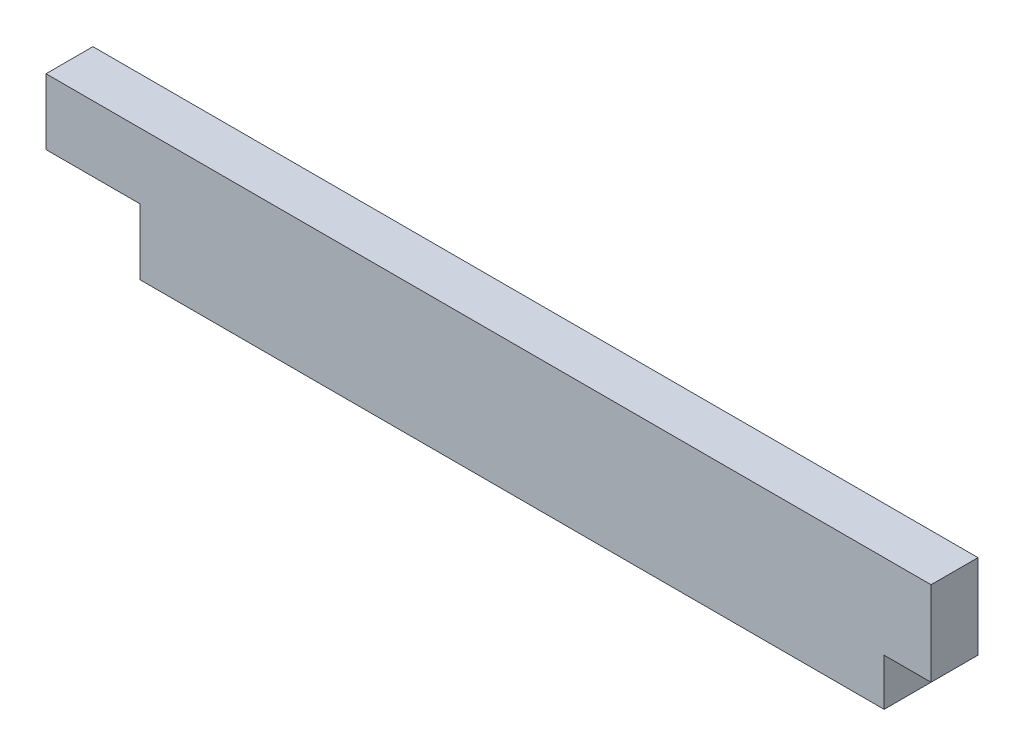
ISO-10303-21;
HEADER;
FILE_DESCRIPTION(('STEP AP214'),'2;1');
FILE_NAME('part.step','',(''),(''),'','','');
FILE_SCHEMA(('AUTOMOTIVE_DESIGN { 1 0 10303 214 1 1 1 1 }'));
ENDSEC;
DATA;
#1=APPLICATION_CONTEXT('core data for automotive mechanical design processes');
#2=APPLICATION_PROTOCOL_DEFINITION('international standard','automotive_design',2000,#1);
#3=PRODUCT_CONTEXT('',#1,'mechanical');
#4=PRODUCT('Part','Part','',(#3));
#5=PRODUCT_RELATED_PRODUCT_CATEGORY('part','',(#4));
#6=PRODUCT_DEFINITION_FORMATION('','',#4);
#7=PRODUCT_DEFINITION_CONTEXT('part definition',#1,'design');
#8=PRODUCT_DEFINITION('design','',#6,#7);
#9=PRODUCT_DEFINITION_SHAPE('','',#8);
#10=(LENGTH_UNIT() NAMED_UNIT(*) SI_UNIT(.MILLI.,.METRE.));
#11=(NAMED_UNIT(*) PLANE_ANGLE_UNIT() SI_UNIT($,.RADIAN.));
#12=(NAMED_UNIT(*) SI_UNIT($,.STERADIAN.) SOLID_ANGLE_UNIT());
#13=UNCERTAINTY_MEASURE_WITH_UNIT(LENGTH_MEASURE(1.E-05),#10,'distance_accuracy_value','');
#14=(GEOMETRIC_REPRESENTATION_CONTEXT(3) GLOBAL_UNCERTAINTY_ASSIGNED_CONTEXT((#13)) GLOBAL_UNIT_ASSIGNED_CONTEXT((#10,
#11,#12)) REPRESENTATION_CONTEXT('',''));
#15=CARTESIAN_POINT('',(0.,0.,0.));
#16=DIRECTION('',(0.,0.,1.));
#17=DIRECTION('',(1.,0.,0.));
#18=AXIS2_PLACEMENT_3D('',#15,#16,#17);
#19=CARTESIAN_POINT('',(26.4,-1.12,1.4));
#20=DIRECTION('',(-1.,0.,0.));
#21=DIRECTION('',(0.,0.,1.));
#22=AXIS2_PLACEMENT_3D('',#19,#20,#21);
#23=PLANE('',#22);
#24=DIRECTION('',(0.,1.,0.));
#25=VECTOR('',#24,1.);
#26=CARTESIAN_POINT('',(26.4,-1.12,-1.4));
#27=LINE('',#26,#25);
#28=CARTESIAN_POINT('',(26.4,-1.12,-1.4));
#29=VERTEX_POINT('',#28);
#30=CARTESIAN_POINT('',(26.4,3.92,-1.4));
#31=VERTEX_POINT('',#30);
#32=EDGE_CURVE('E133',#29,#31,#27,.T.);
#33=ORIENTED_EDGE('',*,*,#32,.T.);
#34=DIRECTION('',(0.,0.,-1.));
#35=VECTOR('',#34,1.);
#36=CARTESIAN_POINT('',(26.4,3.92,1.4));
#37=LINE('',#36,#35);
#38=CARTESIAN_POINT('',(26.4,3.92,1.4));
#39=VERTEX_POINT('',#38);
#40=EDGE_CURVE('E11',#39,#31,#37,.T.);
#41=ORIENTED_EDGE('',*,*,#40,.F.);
#42=DIRECTION('',(0.,1.,0.));
#43=VECTOR('',#42,1.);
#44=CARTESIAN_POINT('',(26.4,-1.12,1.4));
#45=LINE('',#44,#43);
#46=CARTESIAN_POINT('',(26.4,-1.12,1.4));
#47=VERTEX_POINT('',#46);
#48=EDGE_CURVE('E147',#47,#39,#45,.T.);
#49=ORIENTED_EDGE('',*,*,#48,.F.);
#50=DIRECTION('',(0.,0.,-1.));
#51=VECTOR('',#50,1.);
#52=CARTESIAN_POINT('',(26.4,-1.12,1.4));
#53=LINE('',#52,#51);
#54=EDGE_CURVE('E129',#47,#29,#53,.T.);
#55=ORIENTED_EDGE('',*,*,#54,.T.);
#56=EDGE_LOOP('',(#33,#41,#49,#55));
#57=FACE_BOUND('',#56,.T.);
#58=ADVANCED_FACE('F37',(#57),#23,.F.);
#59=CARTESIAN_POINT('',(-26.4,3.92,1.4));
#60=DIRECTION('',(0.,-1.,0.));
#61=DIRECTION('',(0.,0.,-1.));
#62=AXIS2_PLACEMENT_3D('',#59,#60,#61);
#63=PLANE('',#62);
#64=DIRECTION('',(-1.,0.,0.));
#65=VECTOR('',#64,1.);
#66=CARTESIAN_POINT('',(-26.4,3.92,-1.4));
#67=LINE('',#66,#65);
#68=CARTESIAN_POINT('',(-26.4,3.92,-1.4));
#69=VERTEX_POINT('',#68);
#70=EDGE_CURVE('E136',#31,#69,#67,.T.);
#71=ORIENTED_EDGE('',*,*,#70,.T.);
#72=DIRECTION('',(0.,0.,-1.));
#73=VECTOR('',#72,1.);
#74=CARTESIAN_POINT('',(-26.4,3.92,1.4));
#75=LINE('',#74,#73);
#76=CARTESIAN_POINT('',(-26.4,3.92,1.4));
#77=VERTEX_POINT('',#76);
#78=EDGE_CURVE('E45',#77,#69,#75,.T.);
#79=ORIENTED_EDGE('',*,*,#78,.F.);
#80=DIRECTION('',(-1.,0.,0.));
#81=VECTOR('',#80,1.);
#82=CARTESIAN_POINT('',(-26.4,3.92,1.4));
#83=LINE('',#82,#81);
#84=EDGE_CURVE('E96',#39,#77,#83,.T.);
#85=ORIENTED_EDGE('',*,*,#84,.F.);
#86=ORIENTED_EDGE('',*,*,#40,.T.);
#87=EDGE_LOOP('',(#71,#79,#85,#86));
#88=FACE_BOUND('',#87,.T.);
#89=ADVANCED_FACE('F182',(#88),#63,.F.);
#90=CARTESIAN_POINT('',(-26.4,0.,1.4));
#91=DIRECTION('',(1.,0.,0.));
#92=DIRECTION('',(0.,0.,-1.));
#93=AXIS2_PLACEMENT_3D('',#90,#91,#92);
#94=PLANE('',#93);
#95=DIRECTION('',(0.,-1.,0.));
#96=VECTOR('',#95,1.);
#97=CARTESIAN_POINT('',(-26.4,0.,-1.4));
#98=LINE('',#97,#96);
#99=CARTESIAN_POINT('',(-26.4,0.,-1.4));
#100=VERTEX_POINT('',#99);
#101=EDGE_CURVE('E138',#69,#100,#98,.T.);
#102=ORIENTED_EDGE('',*,*,#101,.T.);
#103=DIRECTION('',(0.,0.,-1.));
#104=VECTOR('',#103,1.);
#105=CARTESIAN_POINT('',(-26.4,0.,1.4));
#106=LINE('',#105,#104);
#107=CARTESIAN_POINT('',(-26.4,0.,1.4));
#108=VERTEX_POINT('',#107);
#109=EDGE_CURVE('E154',#108,#100,#106,.T.);
#110=ORIENTED_EDGE('',*,*,#109,.F.);
#111=DIRECTION('',(0.,-1.,0.));
#112=VECTOR('',#111,1.);
#113=CARTESIAN_POINT('',(-26.4,0.,1.4));
#114=LINE('',#113,#112);
#115=EDGE_CURVE('E162',#77,#108,#114,.T.);
#116=ORIENTED_EDGE('',*,*,#115,.F.);
#117=ORIENTED_EDGE('',*,*,#78,.T.);
#118=EDGE_LOOP('',(#102,#110,#116,#117));
#119=FACE_BOUND('',#118,.T.);
#120=ADVANCED_FACE('F160',(#119),#94,.F.);
#121=CARTESIAN_POINT('',(-26.4,0.,1.4));
#122=DIRECTION('',(0.,1.,0.));
#123=DIRECTION('',(0.,0.,1.));
#124=AXIS2_PLACEMENT_3D('',#121,#122,#123);
#125=PLANE('',#124);
#126=DIRECTION('',(1.,0.,0.));
#127=VECTOR('',#126,1.);
#128=CARTESIAN_POINT('',(-26.4,0.,-1.4));
#129=LINE('',#128,#127);
#130=CARTESIAN_POINT('',(-20.8,0.,-1.4));
#131=VERTEX_POINT('',#130);
#132=EDGE_CURVE('E140',#100,#131,#129,.T.);
#133=ORIENTED_EDGE('',*,*,#132,.T.);
#134=DIRECTION('',(0.,0.,-1.));
#135=VECTOR('',#134,1.);
#136=CARTESIAN_POINT('',(-20.8,0.,1.4));
#137=LINE('',#136,#135);
#138=CARTESIAN_POINT('',(-20.8,0.,1.4));
#139=VERTEX_POINT('',#138);
#140=EDGE_CURVE('E151',#139,#131,#137,.T.);
#141=ORIENTED_EDGE('',*,*,#140,.F.);
#142=DIRECTION('',(1.,0.,0.));
#143=VECTOR('',#142,1.);
#144=CARTESIAN_POINT('',(-26.4,0.,1.4));
#145=LINE('',#144,#143);
#146=EDGE_CURVE('E174',#108,#139,#145,.T.);
#147=ORIENTED_EDGE('',*,*,#146,.F.);
#148=ORIENTED_EDGE('',*,*,#109,.T.);
#149=EDGE_LOOP('',(#133,#141,#147,#148));
#150=FACE_BOUND('',#149,.T.);
#151=ADVANCED_FACE('F170',(#150),#125,.F.);
#152=CARTESIAN_POINT('',(-20.8,0.,1.4));
#153=DIRECTION('',(1.,0.,0.));
#154=DIRECTION('',(0.,0.,-1.));
#155=AXIS2_PLACEMENT_3D('',#152,#153,#154);
#156=PLANE('',#155);
#157=DIRECTION('',(0.,-1.,0.));
#158=VECTOR('',#157,1.);
#159=CARTESIAN_POINT('',(-20.8,0.,-1.4));
#160=LINE('',#159,#158);
#161=CARTESIAN_POINT('',(-20.8,-3.92,-1.4));
#162=VERTEX_POINT('',#161);
#163=EDGE_CURVE('E142',#131,#162,#160,.T.);
#164=ORIENTED_EDGE('',*,*,#163,.T.);
#165=DIRECTION('',(0.,0.,-1.));
#166=VECTOR('',#165,1.);
#167=CARTESIAN_POINT('',(-20.8,-3.92,1.4));
#168=LINE('',#167,#166);
#169=CARTESIAN_POINT('',(-20.8,-3.92,1.4));
#170=VERTEX_POINT('',#169);
#171=EDGE_CURVE('E124',#170,#162,#168,.T.);
#172=ORIENTED_EDGE('',*,*,#171,.F.);
#173=DIRECTION('',(0.,-1.,0.));
#174=VECTOR('',#173,1.);
#175=CARTESIAN_POINT('',(-20.8,0.,1.4));
#176=LINE('',#175,#174);
#177=EDGE_CURVE('E115',#139,#170,#176,.T.);
#178=ORIENTED_EDGE('',*,*,#177,.F.);
#179=ORIENTED_EDGE('',*,*,#140,.T.);
#180=EDGE_LOOP('',(#164,#172,#178,#179));
#181=FACE_BOUND('',#180,.T.);
#182=ADVANCED_FACE('F173',(#181),#156,.F.);
#183=CARTESIAN_POINT('',(-20.8,-3.92,1.4));
#184=DIRECTION('',(0.,1.,0.));
#185=DIRECTION('',(0.,0.,1.));
#186=AXIS2_PLACEMENT_3D('',#183,#184,#185);
#187=PLANE('',#186);
#188=DIRECTION('',(1.,0.,0.));
#189=VECTOR('',#188,1.);
#190=CARTESIAN_POINT('',(-20.8,-3.92,-1.4));
#191=LINE('',#190,#189);
#192=CARTESIAN_POINT('',(23.6,-3.92,-1.4));
#193=VERTEX_POINT('',#192);
#194=EDGE_CURVE('E123',#162,#193,#191,.T.);
#195=ORIENTED_EDGE('',*,*,#194,.T.);
#196=DIRECTION('',(0.,0.,-1.));
#197=VECTOR('',#196,1.);
#198=CARTESIAN_POINT('',(23.6,-3.92,1.4));
#199=LINE('',#198,#197);
#200=CARTESIAN_POINT('',(23.6,-3.92,1.4));
#201=VERTEX_POINT('',#200);
#202=EDGE_CURVE('E120',#201,#193,#199,.T.);
#203=ORIENTED_EDGE('',*,*,#202,.F.);
#204=DIRECTION('',(1.,0.,0.));
#205=VECTOR('',#204,1.);
#206=CARTESIAN_POINT('',(-20.8,-3.92,1.4));
#207=LINE('',#206,#205);
#208=EDGE_CURVE('E109',#170,#201,#207,.T.);
#209=ORIENTED_EDGE('',*,*,#208,.F.);
#210=ORIENTED_EDGE('',*,*,#171,.T.);
#211=EDGE_LOOP('',(#195,#203,#209,#210));
#212=FACE_BOUND('',#211,.T.);
#213=ADVANCED_FACE('F121',(#212),#187,.F.);
#214=CARTESIAN_POINT('',(23.6,-1.12,1.4));
#215=DIRECTION('',(-1.,0.,0.));
#216=DIRECTION('',(0.,0.,1.));
#217=AXIS2_PLACEMENT_3D('',#214,#215,#216);
#218=PLANE('',#217);
#219=DIRECTION('',(0.,1.,0.));
#220=VECTOR('',#219,1.);
#221=CARTESIAN_POINT('',(23.6,-1.12,-1.4));
#222=LINE('',#221,#220);
#223=CARTESIAN_POINT('',(23.6,-1.12,-1.4));
#224=VERTEX_POINT('',#223);
#225=EDGE_CURVE('E82',#193,#224,#222,.T.);
#226=ORIENTED_EDGE('',*,*,#225,.T.);
#227=DIRECTION('',(0.,0.,-1.));
#228=VECTOR('',#227,1.);
#229=CARTESIAN_POINT('',(23.6,-1.12,1.4));
#230=LINE('',#229,#228);
#231=CARTESIAN_POINT('',(23.6,-1.12,1.4));
#232=VERTEX_POINT('',#231);
#233=EDGE_CURVE('E125',#232,#224,#230,.T.);
#234=ORIENTED_EDGE('',*,*,#233,.F.);
#235=DIRECTION('',(0.,1.,0.));
#236=VECTOR('',#235,1.);
#237=CARTESIAN_POINT('',(23.6,-1.12,1.4));
#238=LINE('',#237,#236);
#239=EDGE_CURVE('E113',#201,#232,#238,.T.);
#240=ORIENTED_EDGE('',*,*,#239,.F.);
#241=ORIENTED_EDGE('',*,*,#202,.T.);
#242=EDGE_LOOP('',(#226,#234,#240,#241));
#243=FACE_BOUND('',#242,.T.);
#244=ADVANCED_FACE('F127',(#243),#218,.F.);
#245=CARTESIAN_POINT('',(26.4,-1.12,1.4));
#246=DIRECTION('',(0.,1.,0.));
#247=DIRECTION('',(-1.,0.,0.));
#248=AXIS2_PLACEMENT_3D('',#245,#246,#247);
#249=PLANE('',#248);
#250=DIRECTION('',(1.,0.,0.));
#251=VECTOR('',#250,1.);
#252=CARTESIAN_POINT('',(26.4,-1.12,-1.4));
#253=LINE('',#252,#251);
#254=EDGE_CURVE('E88',#224,#29,#253,.T.);
#255=ORIENTED_EDGE('',*,*,#254,.T.);
#256=ORIENTED_EDGE('',*,*,#54,.F.);
#257=DIRECTION('',(1.,0.,0.));
#258=VECTOR('',#257,1.);
#259=CARTESIAN_POINT('',(26.4,-1.12,1.4));
#260=LINE('',#259,#258);
#261=EDGE_CURVE('E53',#232,#47,#260,.T.);
#262=ORIENTED_EDGE('',*,*,#261,.F.);
#263=ORIENTED_EDGE('',*,*,#233,.T.);
#264=EDGE_LOOP('',(#255,#256,#262,#263));
#265=FACE_BOUND('',#264,.T.);
#266=ADVANCED_FACE('F198',(#265),#249,.F.);
#267=CARTESIAN_POINT('',(0.,0.,1.4));
#268=DIRECTION('',(0.,0.,-1.));
#269=DIRECTION('',(-1.,0.,0.));
#270=AXIS2_PLACEMENT_3D('',#267,#268,#269);
#271=PLANE('',#270);
#272=ORIENTED_EDGE('',*,*,#48,.T.);
#273=ORIENTED_EDGE('',*,*,#84,.T.);
#274=ORIENTED_EDGE('',*,*,#115,.T.);
#275=ORIENTED_EDGE('',*,*,#146,.T.);
#276=ORIENTED_EDGE('',*,*,#177,.T.);
#277=ORIENTED_EDGE('',*,*,#208,.T.);
#278=ORIENTED_EDGE('',*,*,#239,.T.);
#279=ORIENTED_EDGE('',*,*,#261,.T.);
#280=EDGE_LOOP('',(#272,#273,#274,#275,#276,#277,#278,#279));
#281=FACE_BOUND('',#280,.T.);
#282=ADVANCED_FACE('F111',(#281),#271,.F.);
#283=CARTESIAN_POINT('',(0.,0.,-1.4));
#284=DIRECTION('',(0.,0.,-1.));
#285=DIRECTION('',(-1.,0.,0.));
#286=AXIS2_PLACEMENT_3D('',#283,#284,#285);
#287=PLANE('',#286);
#288=ORIENTED_EDGE('',*,*,#32,.F.);
#289=ORIENTED_EDGE('',*,*,#254,.F.);
#290=ORIENTED_EDGE('',*,*,#225,.F.);
#291=ORIENTED_EDGE('',*,*,#194,.F.);
#292=ORIENTED_EDGE('',*,*,#163,.F.);
#293=ORIENTED_EDGE('',*,*,#132,.F.);
#294=ORIENTED_EDGE('',*,*,#101,.F.);
#295=ORIENTED_EDGE('',*,*,#70,.F.);
#296=EDGE_LOOP('',(#288,#289,#290,#291,#292,#293,#294,#295));
#297=FACE_BOUND('',#296,.T.);
#298=ADVANCED_FACE('F166',(#297),#287,.T.);
#299=CLOSED_SHELL('',(#58,#89,#120,#151,#182,#213,#244,#266,#282,#298));
#300=MANIFOLD_SOLID_BREP('B2',#299);
#301=ADVANCED_BREP_SHAPE_REPRESENTATION('',(#18,#300),#14);
#302=SHAPE_DEFINITION_REPRESENTATION(#9,#301);
ENDSEC;
END-ISO-10303-21;
